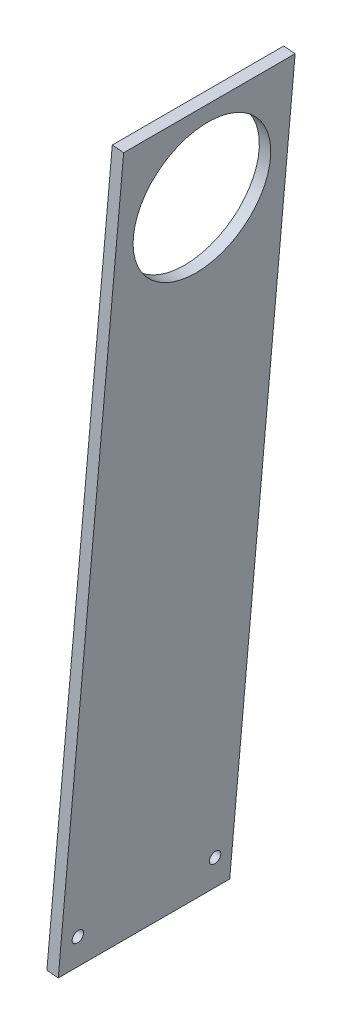
ISO-10303-21;
HEADER;
FILE_DESCRIPTION(('STEP AP214'),'2;1');
FILE_NAME('part.step','',(''),(''),'','','');
FILE_SCHEMA(('AUTOMOTIVE_DESIGN { 1 0 10303 214 1 1 1 1 }'));
ENDSEC;
DATA;
#1=APPLICATION_CONTEXT('core data for automotive mechanical design processes');
#2=APPLICATION_PROTOCOL_DEFINITION('international standard','automotive_design',2000,#1);
#3=PRODUCT_CONTEXT('',#1,'mechanical');
#4=PRODUCT('Part','Part','',(#3));
#5=PRODUCT_RELATED_PRODUCT_CATEGORY('part','',(#4));
#6=PRODUCT_DEFINITION_FORMATION('','',#4);
#7=PRODUCT_DEFINITION_CONTEXT('part definition',#1,'design');
#8=PRODUCT_DEFINITION('design','',#6,#7);
#9=PRODUCT_DEFINITION_SHAPE('','',#8);
#10=(LENGTH_UNIT() NAMED_UNIT(*) SI_UNIT(.MILLI.,.METRE.));
#11=(NAMED_UNIT(*) PLANE_ANGLE_UNIT() SI_UNIT($,.RADIAN.));
#12=(NAMED_UNIT(*) SI_UNIT($,.STERADIAN.) SOLID_ANGLE_UNIT());
#13=UNCERTAINTY_MEASURE_WITH_UNIT(LENGTH_MEASURE(1.E-05),#10,'distance_accuracy_value','');
#14=(GEOMETRIC_REPRESENTATION_CONTEXT(3) GLOBAL_UNCERTAINTY_ASSIGNED_CONTEXT((#13)) GLOBAL_UNIT_ASSIGNED_CONTEXT((#10,
#11,#12)) REPRESENTATION_CONTEXT('',''));
#15=CARTESIAN_POINT('',(0.,0.,0.));
#16=DIRECTION('',(0.,0.,1.));
#17=DIRECTION('',(1.,0.,0.));
#18=AXIS2_PLACEMENT_3D('',#15,#16,#17);
#19=CARTESIAN_POINT('',(6.66477378150632,3.32063379868594,95.25));
#20=DIRECTION('',(-0.996194698091745,0.0871557427476619,0.));
#21=DIRECTION('',(-0.0871557427476619,-0.996194698091745,0.));
#22=AXIS2_PLACEMENT_3D('',#19,#20,#21);
#23=PLANE('',#22);
#24=CARTESIAN_POINT('',(8.04837119762546,19.1352246308924,85.725));
#25=DIRECTION('',(-0.996194698091745,0.0871557427476619,0.));
#26=DIRECTION('',(-0.0871557427476619,-0.996194698091745,0.));
#27=AXIS2_PLACEMENT_3D('',#24,#25,#26);
#28=CIRCLE('',#27,3.175);
#29=CARTESIAN_POINT('',(7.77165171440163,15.9723064644511,85.725));
#30=VERTEX_POINT('',#29);
#31=EDGE_CURVE('E121',#30,#30,#28,.T.);
#32=ORIENTED_EDGE('',*,*,#31,.T.);
#33=EDGE_LOOP('',(#32));
#34=FACE_BOUND('',#33,.T.);
#35=CARTESIAN_POINT('',(8.04837119762546,19.1352246308924,9.525));
#36=DIRECTION('',(-0.996194698091745,0.0871557427476619,0.));
#37=DIRECTION('',(-0.0871557427476619,-0.996194698091745,0.));
#38=AXIS2_PLACEMENT_3D('',#35,#36,#37);
#39=CIRCLE('',#38,3.175);
#40=CARTESIAN_POINT('',(7.77165171440163,15.9723064644511,9.525));
#41=VERTEX_POINT('',#40);
#42=EDGE_CURVE('E115',#41,#41,#39,.T.);
#43=ORIENTED_EDGE('',*,*,#42,.T.);
#44=EDGE_LOOP('',(#43));
#45=FACE_BOUND('',#44,.T.);
#46=CARTESIAN_POINT('',(38.8415429682415,371.102788536933,47.625));
#47=DIRECTION('',(-0.996194698091745,0.0871557427476619,0.));
#48=DIRECTION('',(-0.0871557427476619,-0.996194698091745,0.));
#49=AXIS2_PLACEMENT_3D('',#46,#47,#48);
#50=CIRCLE('',#49,38.1);
#51=CARTESIAN_POINT('',(35.5209091695556,333.147770539638,47.625));
#52=VERTEX_POINT('',#51);
#53=EDGE_CURVE('E99',#52,#52,#50,.T.);
#54=ORIENTED_EDGE('',*,*,#53,.T.);
#55=EDGE_LOOP('',(#54));
#56=FACE_BOUND('',#55,.T.);
#57=DIRECTION('',(0.0871557427476619,0.996194698091745,0.));
#58=VECTOR('',#57,1.);
#59=CARTESIAN_POINT('',(6.66477378150632,3.32063379868594,0.));
#60=LINE('',#59,#58);
#61=CARTESIAN_POINT('',(6.66477378150632,3.32063379868594,0.));
#62=VERTEX_POINT('',#61);
#63=CARTESIAN_POINT('',(42.9923352165989,418.546561033552,0.));
#64=VERTEX_POINT('',#63);
#65=EDGE_CURVE('E96',#62,#64,#60,.T.);
#66=ORIENTED_EDGE('',*,*,#65,.T.);
#67=DIRECTION('',(0.,0.,-1.));
#68=VECTOR('',#67,1.);
#69=CARTESIAN_POINT('',(42.9923352165989,418.546561033552,95.25));
#70=LINE('',#69,#68);
#71=CARTESIAN_POINT('',(42.9923352165989,418.546561033552,95.25));
#72=VERTEX_POINT('',#71);
#73=EDGE_CURVE('E11',#72,#64,#70,.T.);
#74=ORIENTED_EDGE('',*,*,#73,.F.);
#75=DIRECTION('',(0.0871557427476619,0.996194698091745,0.));
#76=VECTOR('',#75,1.);
#77=CARTESIAN_POINT('',(6.66477378150632,3.32063379868594,95.25));
#78=LINE('',#77,#76);
#79=CARTESIAN_POINT('',(6.66477378150632,3.32063379868594,95.25));
#80=VERTEX_POINT('',#79);
#81=EDGE_CURVE('E84',#80,#72,#78,.T.);
#82=ORIENTED_EDGE('',*,*,#81,.F.);
#83=DIRECTION('',(0.,0.,-1.));
#84=VECTOR('',#83,1.);
#85=CARTESIAN_POINT('',(6.66477378150632,3.32063379868594,95.25));
#86=LINE('',#85,#84);
#87=EDGE_CURVE('E92',#80,#62,#86,.T.);
#88=ORIENTED_EDGE('',*,*,#87,.T.);
#89=EDGE_LOOP('',(#66,#74,#82,#88));
#90=FACE_BOUND('',#89,.T.);
#91=ADVANCED_FACE('F33',(#34,#45,#56,#90),#23,.F.);
#92=CARTESIAN_POINT('',(42.9923352165989,418.546561033552,95.25));
#93=DIRECTION('',(-0.0871557427476633,-0.996194698091745,0.));
#94=DIRECTION('',(0.996194698091745,-0.0871557427476633,0.));
#95=AXIS2_PLACEMENT_3D('',#92,#93,#94);
#96=PLANE('',#95);
#97=DIRECTION('',(-0.996194698091745,0.0871557427476633,0.));
#98=VECTOR('',#97,1.);
#99=CARTESIAN_POINT('',(42.9923352165989,418.546561033552,0.));
#100=LINE('',#99,#98);
#101=CARTESIAN_POINT('',(36.6664988837163,419.1,0.));
#102=VERTEX_POINT('',#101);
#103=EDGE_CURVE('E88',#64,#102,#100,.T.);
#104=ORIENTED_EDGE('',*,*,#103,.T.);
#105=DIRECTION('',(0.,0.,-1.));
#106=VECTOR('',#105,1.);
#107=CARTESIAN_POINT('',(36.6664988837163,419.1,95.25));
#108=LINE('',#107,#106);
#109=CARTESIAN_POINT('',(36.6664988837163,419.1,95.25));
#110=VERTEX_POINT('',#109);
#111=EDGE_CURVE('E41',#110,#102,#108,.T.);
#112=ORIENTED_EDGE('',*,*,#111,.F.);
#113=DIRECTION('',(-0.996194698091745,0.0871557427476633,0.));
#114=VECTOR('',#113,1.);
#115=CARTESIAN_POINT('',(42.9923352165989,418.546561033552,95.25));
#116=LINE('',#115,#114);
#117=EDGE_CURVE('E79',#72,#110,#116,.T.);
#118=ORIENTED_EDGE('',*,*,#117,.F.);
#119=ORIENTED_EDGE('',*,*,#73,.T.);
#120=EDGE_LOOP('',(#104,#112,#118,#119));
#121=FACE_BOUND('',#120,.T.);
#122=ADVANCED_FACE('F87',(#121),#96,.F.);
#123=CARTESIAN_POINT('',(0.338937448623741,3.8740727651336,95.25));
#124=DIRECTION('',(0.996194698091745,-0.0871557427476619,0.));
#125=DIRECTION('',(0.0871557427476619,0.996194698091745,0.));
#126=AXIS2_PLACEMENT_3D('',#123,#124,#125);
#127=PLANE('',#126);
#128=CARTESIAN_POINT('',(1.72253486474287,19.6886635973401,85.725));
#129=DIRECTION('',(-0.996194698091745,0.0871557427476619,0.));
#130=DIRECTION('',(-0.0871557427476619,-0.996194698091745,0.));
#131=AXIS2_PLACEMENT_3D('',#128,#129,#130);
#132=CIRCLE('',#131,3.175);
#133=CARTESIAN_POINT('',(1.44581538151904,16.5257454308988,85.725));
#134=VERTEX_POINT('',#133);
#135=EDGE_CURVE('E124',#134,#134,#132,.T.);
#136=ORIENTED_EDGE('',*,*,#135,.F.);
#137=EDGE_LOOP('',(#136));
#138=FACE_BOUND('',#137,.T.);
#139=CARTESIAN_POINT('',(1.72253486474287,19.6886635973401,9.525));
#140=DIRECTION('',(-0.996194698091745,0.0871557427476619,0.));
#141=DIRECTION('',(-0.0871557427476619,-0.996194698091745,0.));
#142=AXIS2_PLACEMENT_3D('',#139,#140,#141);
#143=CIRCLE('',#142,3.175);
#144=CARTESIAN_POINT('',(1.44581538151904,16.5257454308988,9.525));
#145=VERTEX_POINT('',#144);
#146=EDGE_CURVE('E118',#145,#145,#143,.T.);
#147=ORIENTED_EDGE('',*,*,#146,.F.);
#148=EDGE_LOOP('',(#147));
#149=FACE_BOUND('',#148,.T.);
#150=CARTESIAN_POINT('',(32.5157066353589,371.656227503381,47.625));
#151=DIRECTION('',(-0.996194698091745,0.0871557427476619,0.));
#152=DIRECTION('',(-0.0871557427476619,-0.996194698091745,0.));
#153=AXIS2_PLACEMENT_3D('',#150,#151,#152);
#154=CIRCLE('',#153,38.1);
#155=CARTESIAN_POINT('',(29.195072836673,333.701209506085,47.625));
#156=VERTEX_POINT('',#155);
#157=EDGE_CURVE('E112',#156,#156,#154,.T.);
#158=ORIENTED_EDGE('',*,*,#157,.F.);
#159=EDGE_LOOP('',(#158));
#160=FACE_BOUND('',#159,.T.);
#161=DIRECTION('',(-0.0871557427476619,-0.996194698091745,0.));
#162=VECTOR('',#161,1.);
#163=CARTESIAN_POINT('',(0.338937448623741,3.8740727651336,0.));
#164=LINE('',#163,#162);
#165=CARTESIAN_POINT('',(0.338937448623741,3.8740727651336,0.));
#166=VERTEX_POINT('',#165);
#167=EDGE_CURVE('E66',#102,#166,#164,.T.);
#168=ORIENTED_EDGE('',*,*,#167,.T.);
#169=DIRECTION('',(0.,0.,-1.));
#170=VECTOR('',#169,1.);
#171=CARTESIAN_POINT('',(0.338937448623741,3.8740727651336,95.25));
#172=LINE('',#171,#170);
#173=CARTESIAN_POINT('',(0.338937448623741,3.8740727651336,95.25));
#174=VERTEX_POINT('',#173);
#175=EDGE_CURVE('E89',#174,#166,#172,.T.);
#176=ORIENTED_EDGE('',*,*,#175,.F.);
#177=DIRECTION('',(-0.0871557427476619,-0.996194698091745,0.));
#178=VECTOR('',#177,1.);
#179=CARTESIAN_POINT('',(0.338937448623741,3.8740727651336,95.25));
#180=LINE('',#179,#178);
#181=EDGE_CURVE('E82',#110,#174,#180,.T.);
#182=ORIENTED_EDGE('',*,*,#181,.F.);
#183=ORIENTED_EDGE('',*,*,#111,.T.);
#184=EDGE_LOOP('',(#168,#176,#182,#183));
#185=FACE_BOUND('',#184,.T.);
#186=ADVANCED_FACE('F90',(#138,#149,#160,#185),#127,.F.);
#187=CARTESIAN_POINT('',(6.66477378150632,3.32063379868594,95.25));
#188=DIRECTION('',(0.0871557427476623,0.996194698091745,0.));
#189=DIRECTION('',(-0.996194698091745,0.0871557427476623,0.));
#190=AXIS2_PLACEMENT_3D('',#187,#188,#189);
#191=PLANE('',#190);
#192=DIRECTION('',(0.996194698091745,-0.0871557427476622,0.));
#193=VECTOR('',#192,1.);
#194=CARTESIAN_POINT('',(6.66477378150632,3.32063379868594,0.));
#195=LINE('',#194,#193);
#196=EDGE_CURVE('E72',#166,#62,#195,.T.);
#197=ORIENTED_EDGE('',*,*,#196,.T.);
#198=ORIENTED_EDGE('',*,*,#87,.F.);
#199=DIRECTION('',(0.996194698091745,-0.0871557427476622,0.));
#200=VECTOR('',#199,1.);
#201=CARTESIAN_POINT('',(6.66477378150632,3.32063379868594,95.25));
#202=LINE('',#201,#200);
#203=EDGE_CURVE('E49',#174,#80,#202,.T.);
#204=ORIENTED_EDGE('',*,*,#203,.F.);
#205=ORIENTED_EDGE('',*,*,#175,.T.);
#206=EDGE_LOOP('',(#197,#198,#204,#205));
#207=FACE_BOUND('',#206,.T.);
#208=ADVANCED_FACE('F104',(#207),#191,.F.);
#209=CARTESIAN_POINT('',(0.,0.,95.25));
#210=DIRECTION('',(0.,0.,1.));
#211=DIRECTION('',(1.,0.,0.));
#212=AXIS2_PLACEMENT_3D('',#209,#210,#211);
#213=PLANE('',#212);
#214=ORIENTED_EDGE('',*,*,#81,.T.);
#215=ORIENTED_EDGE('',*,*,#117,.T.);
#216=ORIENTED_EDGE('',*,*,#181,.T.);
#217=ORIENTED_EDGE('',*,*,#203,.T.);
#218=EDGE_LOOP('',(#214,#215,#216,#217));
#219=FACE_BOUND('',#218,.T.);
#220=ADVANCED_FACE('F80',(#219),#213,.T.);
#221=CARTESIAN_POINT('',(0.,0.,0.));
#222=DIRECTION('',(0.,0.,1.));
#223=DIRECTION('',(1.,0.,0.));
#224=AXIS2_PLACEMENT_3D('',#221,#222,#223);
#225=PLANE('',#224);
#226=ORIENTED_EDGE('',*,*,#65,.F.);
#227=ORIENTED_EDGE('',*,*,#196,.F.);
#228=ORIENTED_EDGE('',*,*,#167,.F.);
#229=ORIENTED_EDGE('',*,*,#103,.F.);
#230=EDGE_LOOP('',(#226,#227,#228,#229));
#231=FACE_BOUND('',#230,.T.);
#232=ADVANCED_FACE('F107',(#231),#225,.F.);
#233=CARTESIAN_POINT('',(74.893155760441,367.948681115789,47.625));
#234=DIRECTION('',(-0.996194698091745,0.0871557427476618,0.));
#235=DIRECTION('',(-0.0871557427476619,-0.996194698091745,0.));
#236=AXIS2_PLACEMENT_3D('',#233,#234,#235);
#237=CYLINDRICAL_SURFACE('',#236,38.1);
#238=ORIENTED_EDGE('',*,*,#157,.T.);
#239=EDGE_LOOP('',(#238));
#240=FACE_BOUND('',#239,.T.);
#241=ORIENTED_EDGE('',*,*,#53,.F.);
#242=EDGE_LOOP('',(#241));
#243=FACE_BOUND('',#242,.T.);
#244=ADVANCED_FACE('F138',(#240,#243),#237,.F.);
#245=CARTESIAN_POINT('',(44.099983989825,15.9811172097486,9.525));
#246=DIRECTION('',(-0.996194698091745,0.0871557427476618,0.));
#247=DIRECTION('',(-0.0871557427476619,-0.996194698091745,0.));
#248=AXIS2_PLACEMENT_3D('',#245,#246,#247);
#249=CYLINDRICAL_SURFACE('',#248,3.175);
#250=ORIENTED_EDGE('',*,*,#146,.T.);
#251=EDGE_LOOP('',(#250));
#252=FACE_BOUND('',#251,.T.);
#253=ORIENTED_EDGE('',*,*,#42,.F.);
#254=EDGE_LOOP('',(#253));
#255=FACE_BOUND('',#254,.T.);
#256=ADVANCED_FACE('F141',(#252,#255),#249,.F.);
#257=CARTESIAN_POINT('',(44.099983989825,15.9811172097486,85.725));
#258=DIRECTION('',(-0.996194698091745,0.0871557427476618,0.));
#259=DIRECTION('',(-0.0871557427476619,-0.996194698091745,0.));
#260=AXIS2_PLACEMENT_3D('',#257,#258,#259);
#261=CYLINDRICAL_SURFACE('',#260,3.175);
#262=ORIENTED_EDGE('',*,*,#135,.T.);
#263=EDGE_LOOP('',(#262));
#264=FACE_BOUND('',#263,.T.);
#265=ORIENTED_EDGE('',*,*,#31,.F.);
#266=EDGE_LOOP('',(#265));
#267=FACE_BOUND('',#266,.T.);
#268=ADVANCED_FACE('F128',(#264,#267),#261,.F.);
#269=CLOSED_SHELL('',(#91,#122,#186,#208,#220,#232,#244,#256,#268));
#270=MANIFOLD_SOLID_BREP('B2',#269);
#271=ADVANCED_BREP_SHAPE_REPRESENTATION('',(#18,#270),#14);
#272=SHAPE_DEFINITION_REPRESENTATION(#9,#271);
ENDSEC;
END-ISO-10303-21;
